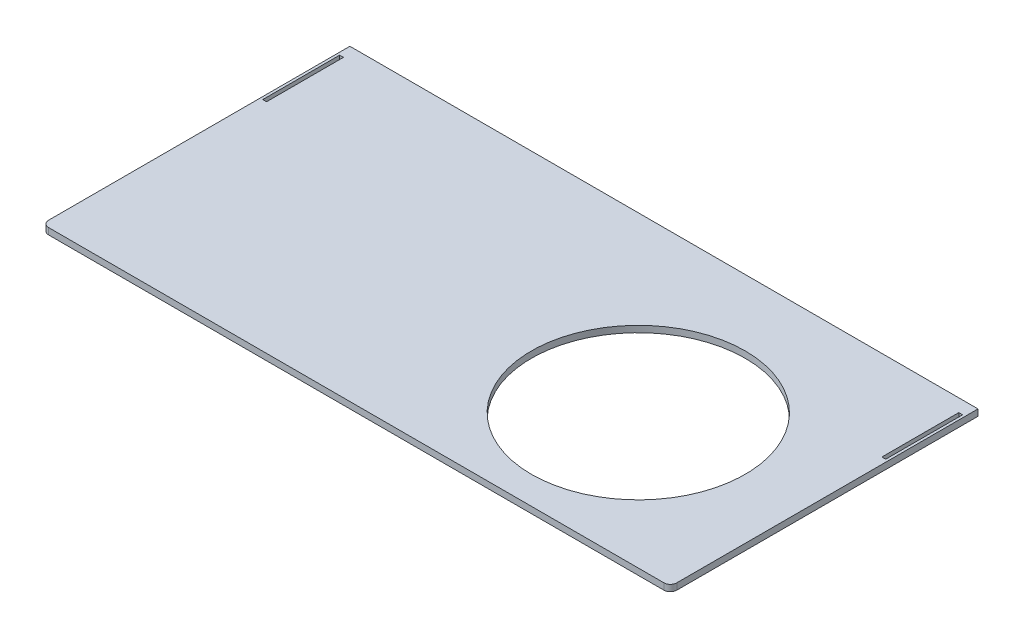
ISO-10303-21;
HEADER;
FILE_DESCRIPTION(('STEP AP214'),'2;1');
FILE_NAME('part.step','',(''),(''),'','','');
FILE_SCHEMA(('AUTOMOTIVE_DESIGN { 1 0 10303 214 1 1 1 1 }'));
ENDSEC;
DATA;
#1=APPLICATION_CONTEXT('core data for automotive mechanical design processes');
#2=APPLICATION_PROTOCOL_DEFINITION('international standard','automotive_design',2000,#1);
#3=PRODUCT_CONTEXT('',#1,'mechanical');
#4=PRODUCT('Part','Part','',(#3));
#5=PRODUCT_RELATED_PRODUCT_CATEGORY('part','',(#4));
#6=PRODUCT_DEFINITION_FORMATION('','',#4);
#7=PRODUCT_DEFINITION_CONTEXT('part definition',#1,'design');
#8=PRODUCT_DEFINITION('design','',#6,#7);
#9=PRODUCT_DEFINITION_SHAPE('','',#8);
#10=(LENGTH_UNIT() NAMED_UNIT(*) SI_UNIT(.MILLI.,.METRE.));
#11=(NAMED_UNIT(*) PLANE_ANGLE_UNIT() SI_UNIT($,.RADIAN.));
#12=(NAMED_UNIT(*) SI_UNIT($,.STERADIAN.) SOLID_ANGLE_UNIT());
#13=UNCERTAINTY_MEASURE_WITH_UNIT(LENGTH_MEASURE(1.E-05),#10,'distance_accuracy_value','');
#14=(GEOMETRIC_REPRESENTATION_CONTEXT(3) GLOBAL_UNCERTAINTY_ASSIGNED_CONTEXT((#13)) GLOBAL_UNIT_ASSIGNED_CONTEXT((#10,
#11,#12)) REPRESENTATION_CONTEXT('',''));
#15=CARTESIAN_POINT('',(0.,0.,0.));
#16=DIRECTION('',(0.,0.,1.));
#17=DIRECTION('',(1.,0.,0.));
#18=AXIS2_PLACEMENT_3D('',#15,#16,#17);
#19=CARTESIAN_POINT('',(311.15,6.35,-152.4));
#20=DIRECTION('',(-1.,0.,0.));
#21=DIRECTION('',(0.,0.,1.));
#22=AXIS2_PLACEMENT_3D('',#19,#20,#21);
#23=PLANE('',#22);
#24=DIRECTION('',(0.,0.,-1.));
#25=VECTOR('',#24,1.);
#26=CARTESIAN_POINT('',(311.15,6.35,-152.4));
#27=LINE('',#26,#25);
#28=CARTESIAN_POINT('',(311.15,6.35,146.05));
#29=VERTEX_POINT('',#28);
#30=CARTESIAN_POINT('',(311.15,6.35,-152.4));
#31=VERTEX_POINT('',#30);
#32=EDGE_CURVE('E208',#29,#31,#27,.T.);
#33=ORIENTED_EDGE('',*,*,#32,.F.);
#34=DIRECTION('',(0.,-1.,0.));
#35=VECTOR('',#34,1.);
#36=CARTESIAN_POINT('',(311.15,6.35,146.05));
#37=LINE('',#36,#35);
#38=CARTESIAN_POINT('',(311.15,0.,146.05));
#39=VERTEX_POINT('',#38);
#40=EDGE_CURVE('E233',#29,#39,#37,.T.);
#41=ORIENTED_EDGE('',*,*,#40,.T.);
#42=DIRECTION('',(0.,0.,-1.));
#43=VECTOR('',#42,1.);
#44=CARTESIAN_POINT('',(311.15,0.,-152.4));
#45=LINE('',#44,#43);
#46=CARTESIAN_POINT('',(311.15,0.,-152.4));
#47=VERTEX_POINT('',#46);
#48=EDGE_CURVE('E174',#39,#47,#45,.T.);
#49=ORIENTED_EDGE('',*,*,#48,.T.);
#50=DIRECTION('',(0.,-1.,0.));
#51=VECTOR('',#50,1.);
#52=CARTESIAN_POINT('',(311.15,6.35,-152.4));
#53=LINE('',#52,#51);
#54=EDGE_CURVE('E230',#31,#47,#53,.T.);
#55=ORIENTED_EDGE('',*,*,#54,.F.);
#56=EDGE_LOOP('',(#33,#41,#49,#55));
#57=FACE_BOUND('',#56,.T.);
#58=ADVANCED_FACE('F34',(#57),#23,.F.);
#59=CARTESIAN_POINT('',(-311.15,6.35,-152.4));
#60=DIRECTION('',(0.,0.,1.));
#61=DIRECTION('',(1.,0.,0.));
#62=AXIS2_PLACEMENT_3D('',#59,#60,#61);
#63=PLANE('',#62);
#64=DIRECTION('',(-1.,0.,0.));
#65=VECTOR('',#64,1.);
#66=CARTESIAN_POINT('',(-311.15,0.,-152.4));
#67=LINE('',#66,#65);
#68=CARTESIAN_POINT('',(-311.15,0.,-152.4));
#69=VERTEX_POINT('',#68);
#70=EDGE_CURVE('E221',#47,#69,#67,.T.);
#71=ORIENTED_EDGE('',*,*,#70,.T.);
#72=DIRECTION('',(0.,-1.,0.));
#73=VECTOR('',#72,1.);
#74=CARTESIAN_POINT('',(-311.15,6.35,-152.4));
#75=LINE('',#74,#73);
#76=CARTESIAN_POINT('',(-311.15,6.35,-152.4));
#77=VERTEX_POINT('',#76);
#78=EDGE_CURVE('E219',#77,#69,#75,.T.);
#79=ORIENTED_EDGE('',*,*,#78,.F.);
#80=DIRECTION('',(-1.,0.,0.));
#81=VECTOR('',#80,1.);
#82=CARTESIAN_POINT('',(-311.15,6.35,-152.4));
#83=LINE('',#82,#81);
#84=EDGE_CURVE('E210',#31,#77,#83,.T.);
#85=ORIENTED_EDGE('',*,*,#84,.F.);
#86=ORIENTED_EDGE('',*,*,#54,.T.);
#87=EDGE_LOOP('',(#71,#79,#85,#86));
#88=FACE_BOUND('',#87,.T.);
#89=ADVANCED_FACE('F274',(#88),#63,.F.);
#90=CARTESIAN_POINT('',(-311.15,6.35,-152.4));
#91=DIRECTION('',(1.,0.,0.));
#92=DIRECTION('',(0.,0.,-1.));
#93=AXIS2_PLACEMENT_3D('',#90,#91,#92);
#94=PLANE('',#93);
#95=DIRECTION('',(0.,0.,1.));
#96=VECTOR('',#95,1.);
#97=CARTESIAN_POINT('',(-311.15,0.,-152.4));
#98=LINE('',#97,#96);
#99=CARTESIAN_POINT('',(-311.15,0.,146.05));
#100=VERTEX_POINT('',#99);
#101=EDGE_CURVE('E223',#69,#100,#98,.T.);
#102=ORIENTED_EDGE('',*,*,#101,.T.);
#103=DIRECTION('',(0.,-1.,0.));
#104=VECTOR('',#103,1.);
#105=CARTESIAN_POINT('',(-311.15,6.35,146.05));
#106=LINE('',#105,#104);
#107=CARTESIAN_POINT('',(-311.15,6.35,146.05));
#108=VERTEX_POINT('',#107);
#109=EDGE_CURVE('E11',#100,#108,#106,.F.);
#110=ORIENTED_EDGE('',*,*,#109,.T.);
#111=DIRECTION('',(0.,0.,1.));
#112=VECTOR('',#111,1.);
#113=CARTESIAN_POINT('',(-311.15,6.35,-152.4));
#114=LINE('',#113,#112);
#115=EDGE_CURVE('E213',#77,#108,#114,.T.);
#116=ORIENTED_EDGE('',*,*,#115,.F.);
#117=ORIENTED_EDGE('',*,*,#78,.T.);
#118=EDGE_LOOP('',(#102,#110,#116,#117));
#119=FACE_BOUND('',#118,.T.);
#120=ADVANCED_FACE('F270',(#119),#94,.F.);
#121=CARTESIAN_POINT('',(-311.15,6.35,152.4));
#122=DIRECTION('',(0.,0.,-1.));
#123=DIRECTION('',(-1.,0.,0.));
#124=AXIS2_PLACEMENT_3D('',#121,#122,#123);
#125=PLANE('',#124);
#126=DIRECTION('',(1.,0.,0.));
#127=VECTOR('',#126,1.);
#128=CARTESIAN_POINT('',(-311.15,0.,152.4));
#129=LINE('',#128,#127);
#130=CARTESIAN_POINT('',(-304.8,0.,152.4));
#131=VERTEX_POINT('',#130);
#132=CARTESIAN_POINT('',(304.8,0.,152.4));
#133=VERTEX_POINT('',#132);
#134=EDGE_CURVE('E211',#131,#133,#129,.T.);
#135=ORIENTED_EDGE('',*,*,#134,.T.);
#136=DIRECTION('',(0.,-1.,0.));
#137=VECTOR('',#136,1.);
#138=CARTESIAN_POINT('',(304.8,6.35,152.4));
#139=LINE('',#138,#137);
#140=CARTESIAN_POINT('',(304.8,6.35,152.4));
#141=VERTEX_POINT('',#140);
#142=EDGE_CURVE('E243',#133,#141,#139,.F.);
#143=ORIENTED_EDGE('',*,*,#142,.T.);
#144=DIRECTION('',(1.,0.,0.));
#145=VECTOR('',#144,1.);
#146=CARTESIAN_POINT('',(-311.15,6.35,152.4));
#147=LINE('',#146,#145);
#148=CARTESIAN_POINT('',(-304.8,6.35,152.4));
#149=VERTEX_POINT('',#148);
#150=EDGE_CURVE('E216',#149,#141,#147,.T.);
#151=ORIENTED_EDGE('',*,*,#150,.F.);
#152=DIRECTION('',(0.,-1.,0.));
#153=VECTOR('',#152,1.);
#154=CARTESIAN_POINT('',(-304.8,6.35,152.4));
#155=LINE('',#154,#153);
#156=EDGE_CURVE('E240',#149,#131,#155,.T.);
#157=ORIENTED_EDGE('',*,*,#156,.T.);
#158=EDGE_LOOP('',(#135,#143,#151,#157));
#159=FACE_BOUND('',#158,.T.);
#160=ADVANCED_FACE('F263',(#159),#125,.F.);
#161=CARTESIAN_POINT('',(0.,6.35,0.));
#162=DIRECTION('',(0.,1.,0.));
#163=DIRECTION('',(0.,0.,1.));
#164=AXIS2_PLACEMENT_3D('',#161,#162,#163);
#165=PLANE('',#164);
#166=CARTESIAN_POINT('',(146.05,6.35,19.0500000000001));
#167=DIRECTION('',(0.,1.,0.));
#168=DIRECTION('',(0.,0.,1.));
#169=AXIS2_PLACEMENT_3D('',#166,#167,#168);
#170=CIRCLE('',#169,105.918);
#171=CARTESIAN_POINT('',(146.05,6.35,124.968));
#172=VERTEX_POINT('',#171);
#173=EDGE_CURVE('E161',#172,#172,#170,.T.);
#174=ORIENTED_EDGE('',*,*,#173,.F.);
#175=EDGE_LOOP('',(#174));
#176=FACE_BOUND('',#175,.T.);
#177=DIRECTION('',(0.,0.,1.));
#178=VECTOR('',#177,1.);
#179=CARTESIAN_POINT('',(-308.61,6.35,-63.5000000000001));
#180=LINE('',#179,#178);
#181=CARTESIAN_POINT('',(-308.61,6.35,-139.7));
#182=VERTEX_POINT('',#181);
#183=CARTESIAN_POINT('',(-308.61,6.35,-63.5000000000001));
#184=VERTEX_POINT('',#183);
#185=EDGE_CURVE('E49',#182,#184,#180,.T.);
#186=ORIENTED_EDGE('',*,*,#185,.F.);
#187=DIRECTION('',(-1.,0.,0.));
#188=VECTOR('',#187,1.);
#189=CARTESIAN_POINT('',(-308.61,6.35,-139.7));
#190=LINE('',#189,#188);
#191=CARTESIAN_POINT('',(-304.8,6.35,-139.7));
#192=VERTEX_POINT('',#191);
#193=EDGE_CURVE('E155',#192,#182,#190,.T.);
#194=ORIENTED_EDGE('',*,*,#193,.F.);
#195=DIRECTION('',(0.,0.,-1.));
#196=VECTOR('',#195,1.);
#197=CARTESIAN_POINT('',(-304.8,6.35,-63.5000000000001));
#198=LINE('',#197,#196);
#199=CARTESIAN_POINT('',(-304.8,6.35,-63.5000000000001));
#200=VERTEX_POINT('',#199);
#201=EDGE_CURVE('E158',#200,#192,#198,.T.);
#202=ORIENTED_EDGE('',*,*,#201,.F.);
#203=DIRECTION('',(1.,0.,0.));
#204=VECTOR('',#203,1.);
#205=CARTESIAN_POINT('',(-308.61,6.35,-63.5000000000001));
#206=LINE('',#205,#204);
#207=EDGE_CURVE('E167',#184,#200,#206,.T.);
#208=ORIENTED_EDGE('',*,*,#207,.F.);
#209=EDGE_LOOP('',(#186,#194,#202,#208));
#210=FACE_BOUND('',#209,.T.);
#211=DIRECTION('',(0.,0.,-1.));
#212=VECTOR('',#211,1.);
#213=CARTESIAN_POINT('',(308.61,6.35,-63.5000000000001));
#214=LINE('',#213,#212);
#215=CARTESIAN_POINT('',(308.61,6.35,-63.5000000000001));
#216=VERTEX_POINT('',#215);
#217=CARTESIAN_POINT('',(308.61,6.35,-139.7));
#218=VERTEX_POINT('',#217);
#219=EDGE_CURVE('E57',#216,#218,#214,.T.);
#220=ORIENTED_EDGE('',*,*,#219,.F.);
#221=DIRECTION('',(1.,0.,0.));
#222=VECTOR('',#221,1.);
#223=CARTESIAN_POINT('',(308.61,6.35,-63.5000000000001));
#224=LINE('',#223,#222);
#225=CARTESIAN_POINT('',(304.8,6.35,-63.5000000000001));
#226=VERTEX_POINT('',#225);
#227=EDGE_CURVE('E182',#226,#216,#224,.T.);
#228=ORIENTED_EDGE('',*,*,#227,.F.);
#229=DIRECTION('',(0.,0.,1.));
#230=VECTOR('',#229,1.);
#231=CARTESIAN_POINT('',(304.8,6.35,-63.5000000000001));
#232=LINE('',#231,#230);
#233=CARTESIAN_POINT('',(304.8,6.35,-139.7));
#234=VERTEX_POINT('',#233);
#235=EDGE_CURVE('E197',#234,#226,#232,.T.);
#236=ORIENTED_EDGE('',*,*,#235,.F.);
#237=DIRECTION('',(-1.,0.,0.));
#238=VECTOR('',#237,1.);
#239=CARTESIAN_POINT('',(308.61,6.35,-139.7));
#240=LINE('',#239,#238);
#241=EDGE_CURVE('E193',#218,#234,#240,.T.);
#242=ORIENTED_EDGE('',*,*,#241,.F.);
#243=EDGE_LOOP('',(#220,#228,#236,#242));
#244=FACE_BOUND('',#243,.T.);
#245=ORIENTED_EDGE('',*,*,#150,.T.);
#246=CARTESIAN_POINT('',(304.8,6.35,146.05));
#247=DIRECTION('',(0.,1.,0.));
#248=DIRECTION('',(0.,0.,1.));
#249=AXIS2_PLACEMENT_3D('',#246,#247,#248);
#250=CIRCLE('',#249,6.35);
#251=EDGE_CURVE('E42',#141,#29,#250,.T.);
#252=ORIENTED_EDGE('',*,*,#251,.T.);
#253=ORIENTED_EDGE('',*,*,#32,.T.);
#254=ORIENTED_EDGE('',*,*,#84,.T.);
#255=ORIENTED_EDGE('',*,*,#115,.T.);
#256=CARTESIAN_POINT('',(-304.8,6.35,146.05));
#257=DIRECTION('',(0.,1.,0.));
#258=DIRECTION('',(0.,0.,1.));
#259=AXIS2_PLACEMENT_3D('',#256,#257,#258);
#260=CIRCLE('',#259,6.35);
#261=EDGE_CURVE('E245',#108,#149,#260,.T.);
#262=ORIENTED_EDGE('',*,*,#261,.T.);
#263=EDGE_LOOP('',(#245,#252,#253,#254,#255,#262));
#264=FACE_BOUND('',#263,.T.);
#265=ADVANCED_FACE('F249',(#176,#210,#244,#264),#165,.T.);
#266=CARTESIAN_POINT('',(0.,0.,0.));
#267=DIRECTION('',(0.,1.,0.));
#268=DIRECTION('',(0.,0.,1.));
#269=AXIS2_PLACEMENT_3D('',#266,#267,#268);
#270=PLANE('',#269);
#271=CARTESIAN_POINT('',(146.05,0.,19.0500000000001));
#272=DIRECTION('',(0.,1.,0.));
#273=DIRECTION('',(0.,0.,1.));
#274=AXIS2_PLACEMENT_3D('',#271,#272,#273);
#275=CIRCLE('',#274,105.918);
#276=CARTESIAN_POINT('',(146.05,0.,124.968));
#277=VERTEX_POINT('',#276);
#278=EDGE_CURVE('E194',#277,#277,#275,.T.);
#279=ORIENTED_EDGE('',*,*,#278,.T.);
#280=EDGE_LOOP('',(#279));
#281=FACE_BOUND('',#280,.T.);
#282=DIRECTION('',(-1.,0.,0.));
#283=VECTOR('',#282,1.);
#284=CARTESIAN_POINT('',(-308.61,0.,-139.7));
#285=LINE('',#284,#283);
#286=CARTESIAN_POINT('',(-304.8,0.,-139.7));
#287=VERTEX_POINT('',#286);
#288=CARTESIAN_POINT('',(-308.61,0.,-139.7));
#289=VERTEX_POINT('',#288);
#290=EDGE_CURVE('E142',#287,#289,#285,.T.);
#291=ORIENTED_EDGE('',*,*,#290,.T.);
#292=DIRECTION('',(0.,0.,1.));
#293=VECTOR('',#292,1.);
#294=CARTESIAN_POINT('',(-308.61,0.,-63.5000000000001));
#295=LINE('',#294,#293);
#296=CARTESIAN_POINT('',(-308.61,0.,-63.5000000000001));
#297=VERTEX_POINT('',#296);
#298=EDGE_CURVE('E136',#289,#297,#295,.T.);
#299=ORIENTED_EDGE('',*,*,#298,.T.);
#300=DIRECTION('',(1.,0.,0.));
#301=VECTOR('',#300,1.);
#302=CARTESIAN_POINT('',(-308.61,0.,-63.5000000000001));
#303=LINE('',#302,#301);
#304=CARTESIAN_POINT('',(-304.8,0.,-63.5000000000001));
#305=VERTEX_POINT('',#304);
#306=EDGE_CURVE('E146',#297,#305,#303,.T.);
#307=ORIENTED_EDGE('',*,*,#306,.T.);
#308=DIRECTION('',(0.,0.,-1.));
#309=VECTOR('',#308,1.);
#310=CARTESIAN_POINT('',(-304.8,0.,-63.5000000000001));
#311=LINE('',#310,#309);
#312=EDGE_CURVE('E150',#305,#287,#311,.T.);
#313=ORIENTED_EDGE('',*,*,#312,.T.);
#314=EDGE_LOOP('',(#291,#299,#307,#313));
#315=FACE_BOUND('',#314,.T.);
#316=DIRECTION('',(1.,0.,0.));
#317=VECTOR('',#316,1.);
#318=CARTESIAN_POINT('',(308.61,0.,-63.5000000000001));
#319=LINE('',#318,#317);
#320=CARTESIAN_POINT('',(304.8,0.,-63.5000000000001));
#321=VERTEX_POINT('',#320);
#322=CARTESIAN_POINT('',(308.61,0.,-63.5000000000001));
#323=VERTEX_POINT('',#322);
#324=EDGE_CURVE('E188',#321,#323,#319,.T.);
#325=ORIENTED_EDGE('',*,*,#324,.T.);
#326=DIRECTION('',(0.,0.,-1.));
#327=VECTOR('',#326,1.);
#328=CARTESIAN_POINT('',(308.61,0.,-63.5000000000001));
#329=LINE('',#328,#327);
#330=CARTESIAN_POINT('',(308.61,0.,-139.7));
#331=VERTEX_POINT('',#330);
#332=EDGE_CURVE('E178',#323,#331,#329,.T.);
#333=ORIENTED_EDGE('',*,*,#332,.T.);
#334=DIRECTION('',(-1.,0.,0.));
#335=VECTOR('',#334,1.);
#336=CARTESIAN_POINT('',(308.61,0.,-139.7));
#337=LINE('',#336,#335);
#338=CARTESIAN_POINT('',(304.8,0.,-139.7));
#339=VERTEX_POINT('',#338);
#340=EDGE_CURVE('E181',#331,#339,#337,.T.);
#341=ORIENTED_EDGE('',*,*,#340,.T.);
#342=DIRECTION('',(0.,0.,1.));
#343=VECTOR('',#342,1.);
#344=CARTESIAN_POINT('',(304.8,0.,-63.5000000000001));
#345=LINE('',#344,#343);
#346=EDGE_CURVE('E185',#339,#321,#345,.T.);
#347=ORIENTED_EDGE('',*,*,#346,.T.);
#348=EDGE_LOOP('',(#325,#333,#341,#347));
#349=FACE_BOUND('',#348,.T.);
#350=ORIENTED_EDGE('',*,*,#48,.F.);
#351=CARTESIAN_POINT('',(304.8,0.,146.05));
#352=DIRECTION('',(0.,1.,0.));
#353=DIRECTION('',(0.,0.,1.));
#354=AXIS2_PLACEMENT_3D('',#351,#352,#353);
#355=CIRCLE('',#354,6.35);
#356=EDGE_CURVE('E238',#39,#133,#355,.F.);
#357=ORIENTED_EDGE('',*,*,#356,.T.);
#358=ORIENTED_EDGE('',*,*,#134,.F.);
#359=CARTESIAN_POINT('',(-304.8,0.,146.05));
#360=DIRECTION('',(0.,1.,0.));
#361=DIRECTION('',(0.,0.,1.));
#362=AXIS2_PLACEMENT_3D('',#359,#360,#361);
#363=CIRCLE('',#362,6.35);
#364=EDGE_CURVE('E236',#131,#100,#363,.F.);
#365=ORIENTED_EDGE('',*,*,#364,.T.);
#366=ORIENTED_EDGE('',*,*,#101,.F.);
#367=ORIENTED_EDGE('',*,*,#70,.F.);
#368=EDGE_LOOP('',(#350,#357,#358,#365,#366,#367));
#369=FACE_BOUND('',#368,.T.);
#370=ADVANCED_FACE('F152',(#281,#315,#349,#369),#270,.F.);
#371=CARTESIAN_POINT('',(304.8,6.35,146.05));
#372=DIRECTION('',(0.,-1.,0.));
#373=DIRECTION('',(0.,0.,-1.));
#374=AXIS2_PLACEMENT_3D('',#371,#372,#373);
#375=CYLINDRICAL_SURFACE('',#374,6.35);
#376=ORIENTED_EDGE('',*,*,#251,.F.);
#377=ORIENTED_EDGE('',*,*,#142,.F.);
#378=ORIENTED_EDGE('',*,*,#356,.F.);
#379=ORIENTED_EDGE('',*,*,#40,.F.);
#380=EDGE_LOOP('',(#376,#377,#378,#379));
#381=FACE_BOUND('',#380,.T.);
#382=ADVANCED_FACE('F258',(#381),#375,.T.);
#383=CARTESIAN_POINT('',(-304.8,6.35,146.05));
#384=DIRECTION('',(0.,-1.,0.));
#385=DIRECTION('',(0.,0.,-1.));
#386=AXIS2_PLACEMENT_3D('',#383,#384,#385);
#387=CYLINDRICAL_SURFACE('',#386,6.35);
#388=ORIENTED_EDGE('',*,*,#261,.F.);
#389=ORIENTED_EDGE('',*,*,#109,.F.);
#390=ORIENTED_EDGE('',*,*,#364,.F.);
#391=ORIENTED_EDGE('',*,*,#156,.F.);
#392=EDGE_LOOP('',(#388,#389,#390,#391));
#393=FACE_BOUND('',#392,.T.);
#394=ADVANCED_FACE('F36',(#393),#387,.T.);
#395=CARTESIAN_POINT('',(308.61,0.,-63.5000000000001));
#396=DIRECTION('',(1.,0.,0.));
#397=DIRECTION('',(0.,0.,-1.));
#398=AXIS2_PLACEMENT_3D('',#395,#396,#397);
#399=PLANE('',#398);
#400=ORIENTED_EDGE('',*,*,#219,.T.);
#401=DIRECTION('',(0.,1.,0.));
#402=VECTOR('',#401,1.);
#403=CARTESIAN_POINT('',(308.61,0.,-139.7));
#404=LINE('',#403,#402);
#405=EDGE_CURVE('E191',#331,#218,#404,.T.);
#406=ORIENTED_EDGE('',*,*,#405,.F.);
#407=ORIENTED_EDGE('',*,*,#332,.F.);
#408=DIRECTION('',(0.,1.,0.));
#409=VECTOR('',#408,1.);
#410=CARTESIAN_POINT('',(308.61,0.,-63.5000000000001));
#411=LINE('',#410,#409);
#412=EDGE_CURVE('E168',#323,#216,#411,.T.);
#413=ORIENTED_EDGE('',*,*,#412,.T.);
#414=EDGE_LOOP('',(#400,#406,#407,#413));
#415=FACE_BOUND('',#414,.T.);
#416=ADVANCED_FACE('F289',(#415),#399,.F.);
#417=CARTESIAN_POINT('',(308.61,0.,-63.5000000000001));
#418=DIRECTION('',(0.,0.,1.));
#419=DIRECTION('',(1.,0.,0.));
#420=AXIS2_PLACEMENT_3D('',#417,#418,#419);
#421=PLANE('',#420);
#422=ORIENTED_EDGE('',*,*,#227,.T.);
#423=ORIENTED_EDGE('',*,*,#412,.F.);
#424=ORIENTED_EDGE('',*,*,#324,.F.);
#425=DIRECTION('',(0.,1.,0.));
#426=VECTOR('',#425,1.);
#427=CARTESIAN_POINT('',(304.8,0.,-63.5000000000001));
#428=LINE('',#427,#426);
#429=EDGE_CURVE('E203',#321,#226,#428,.T.);
#430=ORIENTED_EDGE('',*,*,#429,.T.);
#431=EDGE_LOOP('',(#422,#423,#424,#430));
#432=FACE_BOUND('',#431,.T.);
#433=ADVANCED_FACE('F368',(#432),#421,.F.);
#434=CARTESIAN_POINT('',(304.8,0.,-63.5000000000001));
#435=DIRECTION('',(-1.,0.,0.));
#436=DIRECTION('',(0.,0.,1.));
#437=AXIS2_PLACEMENT_3D('',#434,#435,#436);
#438=PLANE('',#437);
#439=ORIENTED_EDGE('',*,*,#235,.T.);
#440=ORIENTED_EDGE('',*,*,#429,.F.);
#441=ORIENTED_EDGE('',*,*,#346,.F.);
#442=DIRECTION('',(0.,1.,0.));
#443=VECTOR('',#442,1.);
#444=CARTESIAN_POINT('',(304.8,0.,-139.7));
#445=LINE('',#444,#443);
#446=EDGE_CURVE('E205',#339,#234,#445,.T.);
#447=ORIENTED_EDGE('',*,*,#446,.T.);
#448=EDGE_LOOP('',(#439,#440,#441,#447));
#449=FACE_BOUND('',#448,.T.);
#450=ADVANCED_FACE('F360',(#449),#438,.F.);
#451=CARTESIAN_POINT('',(308.61,0.,-139.7));
#452=DIRECTION('',(0.,0.,-1.));
#453=DIRECTION('',(-1.,0.,0.));
#454=AXIS2_PLACEMENT_3D('',#451,#452,#453);
#455=PLANE('',#454);
#456=ORIENTED_EDGE('',*,*,#241,.T.);
#457=ORIENTED_EDGE('',*,*,#446,.F.);
#458=ORIENTED_EDGE('',*,*,#340,.F.);
#459=ORIENTED_EDGE('',*,*,#405,.T.);
#460=EDGE_LOOP('',(#456,#457,#458,#459));
#461=FACE_BOUND('',#460,.T.);
#462=ADVANCED_FACE('F353',(#461),#455,.F.);
#463=CARTESIAN_POINT('',(-308.61,0.,-63.5000000000001));
#464=DIRECTION('',(-1.,0.,0.));
#465=DIRECTION('',(0.,0.,1.));
#466=AXIS2_PLACEMENT_3D('',#463,#464,#465);
#467=PLANE('',#466);
#468=ORIENTED_EDGE('',*,*,#185,.T.);
#469=DIRECTION('',(0.,1.,0.));
#470=VECTOR('',#469,1.);
#471=CARTESIAN_POINT('',(-308.61,0.,-63.5000000000001));
#472=LINE('',#471,#470);
#473=EDGE_CURVE('E132',#297,#184,#472,.T.);
#474=ORIENTED_EDGE('',*,*,#473,.F.);
#475=ORIENTED_EDGE('',*,*,#298,.F.);
#476=DIRECTION('',(0.,1.,0.));
#477=VECTOR('',#476,1.);
#478=CARTESIAN_POINT('',(-308.61,0.,-139.7));
#479=LINE('',#478,#477);
#480=EDGE_CURVE('E172',#289,#182,#479,.T.);
#481=ORIENTED_EDGE('',*,*,#480,.T.);
#482=EDGE_LOOP('',(#468,#474,#475,#481));
#483=FACE_BOUND('',#482,.T.);
#484=ADVANCED_FACE('F134',(#483),#467,.F.);
#485=CARTESIAN_POINT('',(-308.61,0.,-139.7));
#486=DIRECTION('',(0.,0.,-1.));
#487=DIRECTION('',(-1.,0.,0.));
#488=AXIS2_PLACEMENT_3D('',#485,#486,#487);
#489=PLANE('',#488);
#490=ORIENTED_EDGE('',*,*,#193,.T.);
#491=ORIENTED_EDGE('',*,*,#480,.F.);
#492=ORIENTED_EDGE('',*,*,#290,.F.);
#493=DIRECTION('',(0.,1.,0.));
#494=VECTOR('',#493,1.);
#495=CARTESIAN_POINT('',(-304.8,0.,-139.7));
#496=LINE('',#495,#494);
#497=EDGE_CURVE('E175',#287,#192,#496,.T.);
#498=ORIENTED_EDGE('',*,*,#497,.T.);
#499=EDGE_LOOP('',(#490,#491,#492,#498));
#500=FACE_BOUND('',#499,.T.);
#501=ADVANCED_FACE('F338',(#500),#489,.F.);
#502=CARTESIAN_POINT('',(-304.8,0.,-63.5000000000001));
#503=DIRECTION('',(1.,0.,0.));
#504=DIRECTION('',(0.,0.,-1.));
#505=AXIS2_PLACEMENT_3D('',#502,#503,#504);
#506=PLANE('',#505);
#507=ORIENTED_EDGE('',*,*,#201,.T.);
#508=ORIENTED_EDGE('',*,*,#497,.F.);
#509=ORIENTED_EDGE('',*,*,#312,.F.);
#510=DIRECTION('',(0.,1.,0.));
#511=VECTOR('',#510,1.);
#512=CARTESIAN_POINT('',(-304.8,0.,-63.5000000000001));
#513=LINE('',#512,#511);
#514=EDGE_CURVE('E141',#305,#200,#513,.T.);
#515=ORIENTED_EDGE('',*,*,#514,.T.);
#516=EDGE_LOOP('',(#507,#508,#509,#515));
#517=FACE_BOUND('',#516,.T.);
#518=ADVANCED_FACE('F334',(#517),#506,.F.);
#519=CARTESIAN_POINT('',(-308.61,0.,-63.5000000000001));
#520=DIRECTION('',(0.,0.,1.));
#521=DIRECTION('',(1.,0.,0.));
#522=AXIS2_PLACEMENT_3D('',#519,#520,#521);
#523=PLANE('',#522);
#524=ORIENTED_EDGE('',*,*,#207,.T.);
#525=ORIENTED_EDGE('',*,*,#514,.F.);
#526=ORIENTED_EDGE('',*,*,#306,.F.);
#527=ORIENTED_EDGE('',*,*,#473,.T.);
#528=EDGE_LOOP('',(#524,#525,#526,#527));
#529=FACE_BOUND('',#528,.T.);
#530=ADVANCED_FACE('F147',(#529),#523,.F.);
#531=CARTESIAN_POINT('',(146.05,0.,19.0500000000001));
#532=DIRECTION('',(0.,1.,0.));
#533=DIRECTION('',(0.,0.,1.));
#534=AXIS2_PLACEMENT_3D('',#531,#532,#533);
#535=CYLINDRICAL_SURFACE('',#534,105.918);
#536=ORIENTED_EDGE('',*,*,#278,.F.);
#537=EDGE_LOOP('',(#536));
#538=FACE_BOUND('',#537,.T.);
#539=ORIENTED_EDGE('',*,*,#173,.T.);
#540=EDGE_LOOP('',(#539));
#541=FACE_BOUND('',#540,.T.);
#542=ADVANCED_FACE('F323',(#538,#541),#535,.F.);
#543=CLOSED_SHELL('',(#58,#89,#120,#160,#265,#370,#382,#394,#416,#433,#450,#462,#484,#501,#518,
#530,#542));
#544=MANIFOLD_SOLID_BREP('B2',#543);
#545=ADVANCED_BREP_SHAPE_REPRESENTATION('',(#18,#544),#14);
#546=SHAPE_DEFINITION_REPRESENTATION(#9,#545);
ENDSEC;
END-ISO-10303-21;
